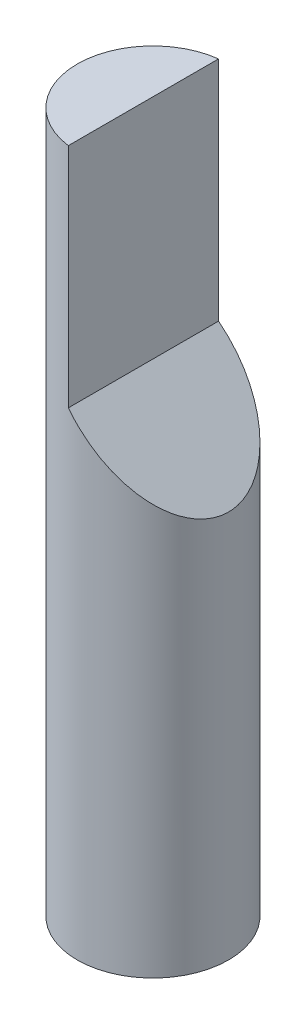
ISO-10303-21;
HEADER;
FILE_DESCRIPTION(('STEP AP214'),'2;1');
FILE_NAME('part.step','',(''),(''),'','','');
FILE_SCHEMA(('AUTOMOTIVE_DESIGN { 1 0 10303 214 1 1 1 1 }'));
ENDSEC;
DATA;
#1=APPLICATION_CONTEXT('core data for automotive mechanical design processes');
#2=APPLICATION_PROTOCOL_DEFINITION('international standard','automotive_design',2000,#1);
#3=PRODUCT_CONTEXT('',#1,'mechanical');
#4=PRODUCT('Part','Part','',(#3));
#5=PRODUCT_RELATED_PRODUCT_CATEGORY('part','',(#4));
#6=PRODUCT_DEFINITION_FORMATION('','',#4);
#7=PRODUCT_DEFINITION_CONTEXT('part definition',#1,'design');
#8=PRODUCT_DEFINITION('design','',#6,#7);
#9=PRODUCT_DEFINITION_SHAPE('','',#8);
#10=(LENGTH_UNIT() NAMED_UNIT(*) SI_UNIT(.MILLI.,.METRE.));
#11=(NAMED_UNIT(*) PLANE_ANGLE_UNIT() SI_UNIT($,.RADIAN.));
#12=(NAMED_UNIT(*) SI_UNIT($,.STERADIAN.) SOLID_ANGLE_UNIT());
#13=UNCERTAINTY_MEASURE_WITH_UNIT(LENGTH_MEASURE(1.E-05),#10,'distance_accuracy_value','');
#14=(GEOMETRIC_REPRESENTATION_CONTEXT(3) GLOBAL_UNCERTAINTY_ASSIGNED_CONTEXT((#13)) GLOBAL_UNIT_ASSIGNED_CONTEXT((#10,
#11,#12)) REPRESENTATION_CONTEXT('',''));
#15=CARTESIAN_POINT('',(0.,0.,0.));
#16=DIRECTION('',(0.,0.,1.));
#17=DIRECTION('',(1.,0.,0.));
#18=AXIS2_PLACEMENT_3D('',#15,#16,#17);
#19=CARTESIAN_POINT('',(0.,3.7,0.));
#20=DIRECTION('',(0.,-1.,0.));
#21=DIRECTION('',(0.,0.,-1.));
#22=AXIS2_PLACEMENT_3D('',#19,#20,#21);
#23=CYLINDRICAL_SURFACE('',#22,0.4);
#24=DIRECTION('',(0.,-1.,0.));
#25=VECTOR('',#24,1.);
#26=CARTESIAN_POINT('',(-0.05,3.7,-0.396862696659689));
#27=LINE('',#26,#25);
#28=CARTESIAN_POINT('',(-0.05,3.7,-0.396862696659689));
#29=VERTEX_POINT('',#28);
#30=CARTESIAN_POINT('',(-0.0499999999999999,2.5,-0.396862696659689));
#31=VERTEX_POINT('',#30);
#32=EDGE_CURVE('E48',#29,#31,#27,.T.);
#33=ORIENTED_EDGE('',*,*,#32,.T.);
#34=CARTESIAN_POINT('',(0.,2.45,0.));
#35=DIRECTION('',(-0.707106781186551,-0.707106781186544,0.));
#36=DIRECTION('',(0.707106781186544,-0.707106781186551,0.));
#37=AXIS2_PLACEMENT_3D('',#34,#35,#36);
#38=ELLIPSE('',#37,0.565685424949241,0.4);
#39=CARTESIAN_POINT('',(-0.0499999999999999,2.5,0.396862696659689));
#40=VERTEX_POINT('',#39);
#41=EDGE_CURVE('E11',#31,#40,#38,.T.);
#42=ORIENTED_EDGE('',*,*,#41,.T.);
#43=DIRECTION('',(0.,-1.,0.));
#44=VECTOR('',#43,1.);
#45=CARTESIAN_POINT('',(-0.05,3.7,0.396862696659689));
#46=LINE('',#45,#44);
#47=CARTESIAN_POINT('',(-0.05,3.7,0.396862696659689));
#48=VERTEX_POINT('',#47);
#49=EDGE_CURVE('E63',#40,#48,#46,.F.);
#50=ORIENTED_EDGE('',*,*,#49,.T.);
#51=CARTESIAN_POINT('',(0.,3.7,0.));
#52=DIRECTION('',(0.,1.,0.));
#53=DIRECTION('',(0.,0.,1.));
#54=AXIS2_PLACEMENT_3D('',#51,#52,#53);
#55=CIRCLE('',#54,0.4);
#56=EDGE_CURVE('E68',#29,#48,#55,.T.);
#57=ORIENTED_EDGE('',*,*,#56,.F.);
#58=EDGE_LOOP('',(#33,#42,#50,#57));
#59=FACE_BOUND('',#58,.T.);
#60=CARTESIAN_POINT('',(0.,0.,0.));
#61=DIRECTION('',(0.,1.,0.));
#62=DIRECTION('',(0.,0.,1.));
#63=AXIS2_PLACEMENT_3D('',#60,#61,#62);
#64=CIRCLE('',#63,0.4);
#65=CARTESIAN_POINT('',(0.,0.,0.4));
#66=VERTEX_POINT('',#65);
#67=EDGE_CURVE('E69',#66,#66,#64,.T.);
#68=ORIENTED_EDGE('',*,*,#67,.T.);
#69=EDGE_LOOP('',(#68));
#70=FACE_BOUND('',#69,.T.);
#71=ADVANCED_FACE('F34',(#59,#70),#23,.T.);
#72=CARTESIAN_POINT('',(0.,3.7,0.));
#73=DIRECTION('',(0.,1.,0.));
#74=DIRECTION('',(0.,0.,1.));
#75=AXIS2_PLACEMENT_3D('',#72,#73,#74);
#76=PLANE('',#75);
#77=DIRECTION('',(0.,0.,1.));
#78=VECTOR('',#77,1.);
#79=CARTESIAN_POINT('',(-0.05,3.7,0.));
#80=LINE('',#79,#78);
#81=EDGE_CURVE('E41',#29,#48,#80,.T.);
#82=ORIENTED_EDGE('',*,*,#81,.F.);
#83=ORIENTED_EDGE('',*,*,#56,.T.);
#84=EDGE_LOOP('',(#82,#83));
#85=FACE_BOUND('',#84,.T.);
#86=ADVANCED_FACE('F76',(#85),#76,.T.);
#87=CARTESIAN_POINT('',(0.,0.,0.));
#88=DIRECTION('',(0.,1.,0.));
#89=DIRECTION('',(0.,0.,1.));
#90=AXIS2_PLACEMENT_3D('',#87,#88,#89);
#91=PLANE('',#90);
#92=ORIENTED_EDGE('',*,*,#67,.F.);
#93=EDGE_LOOP('',(#92));
#94=FACE_BOUND('',#93,.T.);
#95=ADVANCED_FACE('F78',(#94),#91,.F.);
#96=CARTESIAN_POINT('',(-0.0499999999999999,2.5,-0.4));
#97=DIRECTION('',(-0.707106781186551,-0.707106781186544,0.));
#98=DIRECTION('',(0.707106781186544,-0.707106781186551,0.));
#99=AXIS2_PLACEMENT_3D('',#96,#97,#98);
#100=PLANE('',#99);
#101=ORIENTED_EDGE('',*,*,#41,.F.);
#102=DIRECTION('',(0.,0.,1.));
#103=VECTOR('',#102,1.);
#104=CARTESIAN_POINT('',(-0.0499999999999999,2.5,-0.4));
#105=LINE('',#104,#103);
#106=EDGE_CURVE('E60',#31,#40,#105,.T.);
#107=ORIENTED_EDGE('',*,*,#106,.T.);
#108=EDGE_LOOP('',(#101,#107));
#109=FACE_BOUND('',#108,.T.);
#110=ADVANCED_FACE('F59',(#109),#100,.F.);
#111=CARTESIAN_POINT('',(-0.05,3.7,-0.4));
#112=DIRECTION('',(-1.,0.,0.));
#113=DIRECTION('',(0.,-1.,0.));
#114=AXIS2_PLACEMENT_3D('',#111,#112,#113);
#115=PLANE('',#114);
#116=ORIENTED_EDGE('',*,*,#81,.T.);
#117=ORIENTED_EDGE('',*,*,#49,.F.);
#118=ORIENTED_EDGE('',*,*,#106,.F.);
#119=ORIENTED_EDGE('',*,*,#32,.F.);
#120=EDGE_LOOP('',(#116,#117,#118,#119));
#121=FACE_BOUND('',#120,.T.);
#122=ADVANCED_FACE('F62',(#121),#115,.F.);
#123=CLOSED_SHELL('',(#71,#86,#95,#110,#122));
#124=MANIFOLD_SOLID_BREP('B2',#123);
#125=ADVANCED_BREP_SHAPE_REPRESENTATION('',(#18,#124),#14);
#126=SHAPE_DEFINITION_REPRESENTATION(#9,#125);
ENDSEC;
END-ISO-10303-21;
